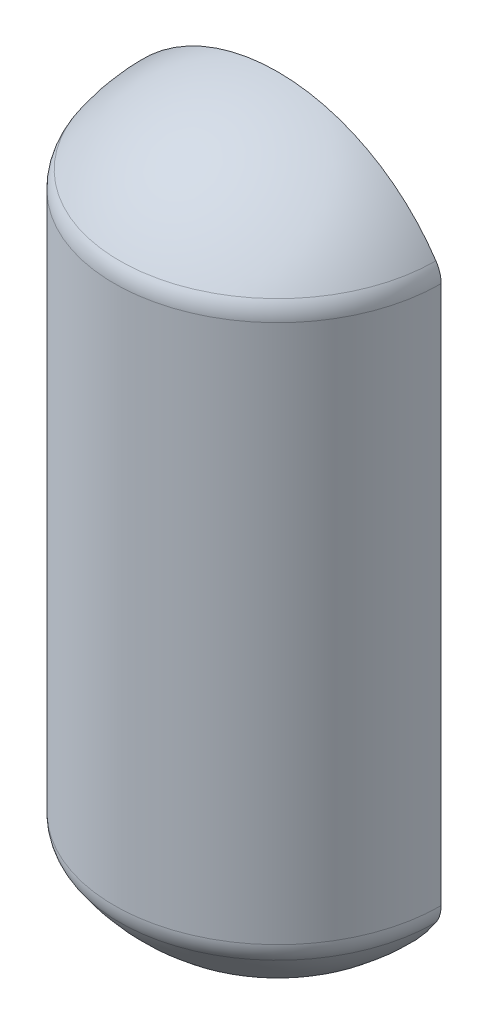
ISO-10303-21;
HEADER;
FILE_DESCRIPTION(('STEP AP214'),'2;1');
FILE_NAME('part.step','',(''),(''),'','','');
FILE_SCHEMA(('AUTOMOTIVE_DESIGN { 1 0 10303 214 1 1 1 1 }'));
ENDSEC;
DATA;
#1=APPLICATION_CONTEXT('core data for automotive mechanical design processes');
#2=APPLICATION_PROTOCOL_DEFINITION('international standard','automotive_design',2000,#1);
#3=PRODUCT_CONTEXT('',#1,'mechanical');
#4=PRODUCT('Part','Part','',(#3));
#5=PRODUCT_RELATED_PRODUCT_CATEGORY('part','',(#4));
#6=PRODUCT_DEFINITION_FORMATION('','',#4);
#7=PRODUCT_DEFINITION_CONTEXT('part definition',#1,'design');
#8=PRODUCT_DEFINITION('design','',#6,#7);
#9=PRODUCT_DEFINITION_SHAPE('','',#8);
#10=(LENGTH_UNIT() NAMED_UNIT(*) SI_UNIT(.MILLI.,.METRE.));
#11=(NAMED_UNIT(*) PLANE_ANGLE_UNIT() SI_UNIT($,.RADIAN.));
#12=(NAMED_UNIT(*) SI_UNIT($,.STERADIAN.) SOLID_ANGLE_UNIT());
#13=UNCERTAINTY_MEASURE_WITH_UNIT(LENGTH_MEASURE(1.E-05),#10,'distance_accuracy_value','');
#14=(GEOMETRIC_REPRESENTATION_CONTEXT(3) GLOBAL_UNCERTAINTY_ASSIGNED_CONTEXT((#13)) GLOBAL_UNIT_ASSIGNED_CONTEXT((#10,
#11,#12)) REPRESENTATION_CONTEXT('',''));
#15=CARTESIAN_POINT('',(0.,0.,0.));
#16=DIRECTION('',(0.,0.,1.));
#17=DIRECTION('',(1.,0.,0.));
#18=AXIS2_PLACEMENT_3D('',#15,#16,#17);
#19=CARTESIAN_POINT('',(0.,453.004854166667,0.));
#20=DIRECTION('',(0.,-1.,0.));
#21=DIRECTION('',(-1.,0.,0.));
#22=AXIS2_PLACEMENT_3D('',#19,#20,#21);
#23=SPHERICAL_SURFACE('',#22,155.895145833333);
#24=CARTESIAN_POINT('',(0.,453.004854166667,0.));
#25=DIRECTION('',(0.,0.,-1.));
#26=DIRECTION('',(-1.,0.,0.));
#27=AXIS2_PLACEMENT_3D('',#24,#25,#26);
#28=CIRCLE('',#27,155.895145833333);
#29=CARTESIAN_POINT('',(-129.720337888526,539.468317158169,9.0583227801243E-13));
#30=VERTEX_POINT('',#29);
#31=CARTESIAN_POINT('',(129.720337888526,539.468317158169,-9.05832278012429E-13));
#32=VERTEX_POINT('',#31);
#33=EDGE_CURVE('E95',#30,#32,#28,.T.);
#34=ORIENTED_EDGE('',*,*,#33,.F.);
#35=CARTESIAN_POINT('',(0.,539.468317158169,0.));
#36=DIRECTION('',(0.,-1.,0.));
#37=DIRECTION('',(0.,0.,-1.));
#38=AXIS2_PLACEMENT_3D('',#35,#36,#37);
#39=CIRCLE('',#38,129.720337888526);
#40=EDGE_CURVE('E11',#30,#32,#39,.F.);
#41=ORIENTED_EDGE('',*,*,#40,.T.);
#42=EDGE_LOOP('',(#34,#41));
#43=FACE_BOUND('',#42,.T.);
#44=ADVANCED_FACE('F37',(#43),#23,.T.);
#45=CARTESIAN_POINT('',(0.,0.,0.));
#46=DIRECTION('',(0.,-1.,0.));
#47=DIRECTION('',(0.,0.,-1.));
#48=AXIS2_PLACEMENT_3D('',#45,#46,#47);
#49=CYLINDRICAL_SURFACE('',#48,133.985);
#50=DIRECTION('',(0.,-1.,0.));
#51=VECTOR('',#50,1.);
#52=CARTESIAN_POINT('',(-133.985,0.,0.));
#53=LINE('',#52,#51);
#54=CARTESIAN_POINT('',(-133.985,525.380822975816,0.));
#55=VERTEX_POINT('',#54);
#56=CARTESIAN_POINT('',(-133.985,83.519177024184,0.));
#57=VERTEX_POINT('',#56);
#58=EDGE_CURVE('E106',#55,#57,#53,.T.);
#59=ORIENTED_EDGE('',*,*,#58,.T.);
#60=CARTESIAN_POINT('',(0.,83.519177024184,0.));
#61=DIRECTION('',(0.,1.,0.));
#62=DIRECTION('',(0.,0.,1.));
#63=AXIS2_PLACEMENT_3D('',#60,#61,#62);
#64=CIRCLE('',#63,133.985);
#65=CARTESIAN_POINT('',(133.985,83.519177024184,-9.35612254369794E-13));
#66=VERTEX_POINT('',#65);
#67=EDGE_CURVE('E45',#57,#66,#64,.T.);
#68=ORIENTED_EDGE('',*,*,#67,.T.);
#69=DIRECTION('',(0.,-1.,0.));
#70=VECTOR('',#69,1.);
#71=CARTESIAN_POINT('',(133.985,0.,-9.35612254369794E-13));
#72=LINE('',#71,#70);
#73=CARTESIAN_POINT('',(133.985,525.380822975816,-9.35612254369794E-13));
#74=VERTEX_POINT('',#73);
#75=EDGE_CURVE('E93',#74,#66,#72,.T.);
#76=ORIENTED_EDGE('',*,*,#75,.F.);
#77=CARTESIAN_POINT('',(0.,525.380822975816,0.));
#78=DIRECTION('',(0.,-1.,0.));
#79=DIRECTION('',(0.,0.,-1.));
#80=AXIS2_PLACEMENT_3D('',#77,#78,#79);
#81=CIRCLE('',#80,133.985);
#82=EDGE_CURVE('E84',#74,#55,#81,.T.);
#83=ORIENTED_EDGE('',*,*,#82,.T.);
#84=EDGE_LOOP('',(#59,#68,#76,#83));
#85=FACE_BOUND('',#84,.T.);
#86=ADVANCED_FACE('F105',(#85),#49,.T.);
#87=CARTESIAN_POINT('',(0.,155.895145833333,0.));
#88=DIRECTION('',(0.,-1.,0.));
#89=DIRECTION('',(1.,0.,0.));
#90=AXIS2_PLACEMENT_3D('',#87,#88,#89);
#91=SPHERICAL_SURFACE('',#90,155.895145833333);
#92=CARTESIAN_POINT('',(0.,155.895145833333,0.));
#93=DIRECTION('',(0.,0.,-1.));
#94=DIRECTION('',(-1.,0.,0.));
#95=AXIS2_PLACEMENT_3D('',#92,#93,#94);
#96=CIRCLE('',#95,155.895145833333);
#97=CARTESIAN_POINT('',(-129.720337888526,69.4316828418309,9.05832278012429E-13));
#98=VERTEX_POINT('',#97);
#99=CARTESIAN_POINT('',(129.720337888526,69.4316828418309,-9.05832278012429E-13));
#100=VERTEX_POINT('',#99);
#101=EDGE_CURVE('E90',#98,#100,#96,.F.);
#102=ORIENTED_EDGE('',*,*,#101,.T.);
#103=CARTESIAN_POINT('',(0.,69.4316828418309,0.));
#104=DIRECTION('',(0.,1.,0.));
#105=DIRECTION('',(0.,0.,1.));
#106=AXIS2_PLACEMENT_3D('',#103,#104,#105);
#107=CIRCLE('',#106,129.720337888526);
#108=EDGE_CURVE('E81',#100,#98,#107,.F.);
#109=ORIENTED_EDGE('',*,*,#108,.T.);
#110=EDGE_LOOP('',(#102,#109));
#111=FACE_BOUND('',#110,.T.);
#112=ADVANCED_FACE('F89',(#111),#91,.T.);
#113=CARTESIAN_POINT('',(0.,0.,0.));
#114=DIRECTION('',(0.,0.,-1.));
#115=DIRECTION('',(-1.,0.,0.));
#116=AXIS2_PLACEMENT_3D('',#113,#114,#115);
#117=PLANE('',#116);
#118=ORIENTED_EDGE('',*,*,#101,.F.);
#119=CARTESIAN_POINT('',(-108.585,83.519177024184,7.58245002356563E-13));
#120=DIRECTION('',(0.,0.,-1.));
#121=DIRECTION('',(-1.,0.,0.));
#122=AXIS2_PLACEMENT_3D('',#119,#120,#121);
#123=CIRCLE('',#122,25.4);
#124=EDGE_CURVE('E77',#98,#57,#123,.T.);
#125=ORIENTED_EDGE('',*,*,#124,.T.);
#126=ORIENTED_EDGE('',*,*,#58,.F.);
#127=CARTESIAN_POINT('',(-108.585,525.380822975816,7.58245002356563E-13));
#128=DIRECTION('',(0.,0.,-1.));
#129=DIRECTION('',(-1.,0.,0.));
#130=AXIS2_PLACEMENT_3D('',#127,#128,#129);
#131=CIRCLE('',#130,25.4);
#132=EDGE_CURVE('E100',#55,#30,#131,.T.);
#133=ORIENTED_EDGE('',*,*,#132,.T.);
#134=ORIENTED_EDGE('',*,*,#33,.T.);
#135=CARTESIAN_POINT('',(108.585,525.380822975816,-7.58245002356563E-13));
#136=DIRECTION('',(0.,0.,-1.));
#137=DIRECTION('',(-1.,0.,0.));
#138=AXIS2_PLACEMENT_3D('',#135,#136,#137);
#139=CIRCLE('',#138,25.4);
#140=EDGE_CURVE('E58',#32,#74,#139,.T.);
#141=ORIENTED_EDGE('',*,*,#140,.T.);
#142=ORIENTED_EDGE('',*,*,#75,.T.);
#143=CARTESIAN_POINT('',(108.585,83.519177024184,-7.58245002356563E-13));
#144=DIRECTION('',(0.,0.,-1.));
#145=DIRECTION('',(-1.,0.,0.));
#146=AXIS2_PLACEMENT_3D('',#143,#144,#145);
#147=CIRCLE('',#146,25.4);
#148=EDGE_CURVE('E85',#66,#100,#147,.T.);
#149=ORIENTED_EDGE('',*,*,#148,.T.);
#150=EDGE_LOOP('',(#118,#125,#126,#133,#134,#141,#142,#149));
#151=FACE_BOUND('',#150,.T.);
#152=ADVANCED_FACE('F92',(#151),#117,.T.);
#153=CARTESIAN_POINT('',(0.,83.519177024184,0.));
#154=DIRECTION('',(0.,1.,0.));
#155=DIRECTION('',(0.,0.,1.));
#156=AXIS2_PLACEMENT_3D('',#153,#154,#155);
#157=TOROIDAL_SURFACE('',#156,108.585,25.4);
#158=ORIENTED_EDGE('',*,*,#148,.F.);
#159=ORIENTED_EDGE('',*,*,#67,.F.);
#160=ORIENTED_EDGE('',*,*,#124,.F.);
#161=ORIENTED_EDGE('',*,*,#108,.F.);
#162=EDGE_LOOP('',(#158,#159,#160,#161));
#163=FACE_BOUND('',#162,.T.);
#164=ADVANCED_FACE('F80',(#163),#157,.T.);
#165=CARTESIAN_POINT('',(0.,525.380822975816,0.));
#166=DIRECTION('',(0.,-1.,0.));
#167=DIRECTION('',(0.,0.,-1.));
#168=AXIS2_PLACEMENT_3D('',#165,#166,#167);
#169=TOROIDAL_SURFACE('',#168,108.585,25.4);
#170=ORIENTED_EDGE('',*,*,#140,.F.);
#171=ORIENTED_EDGE('',*,*,#40,.F.);
#172=ORIENTED_EDGE('',*,*,#132,.F.);
#173=ORIENTED_EDGE('',*,*,#82,.F.);
#174=EDGE_LOOP('',(#170,#171,#172,#173));
#175=FACE_BOUND('',#174,.T.);
#176=ADVANCED_FACE('F39',(#175),#169,.T.);
#177=CLOSED_SHELL('',(#44,#86,#112,#152,#164,#176));
#178=MANIFOLD_SOLID_BREP('B2',#177);
#179=ADVANCED_BREP_SHAPE_REPRESENTATION('',(#18,#178),#14);
#180=SHAPE_DEFINITION_REPRESENTATION(#9,#179);
ENDSEC;
END-ISO-10303-21;
